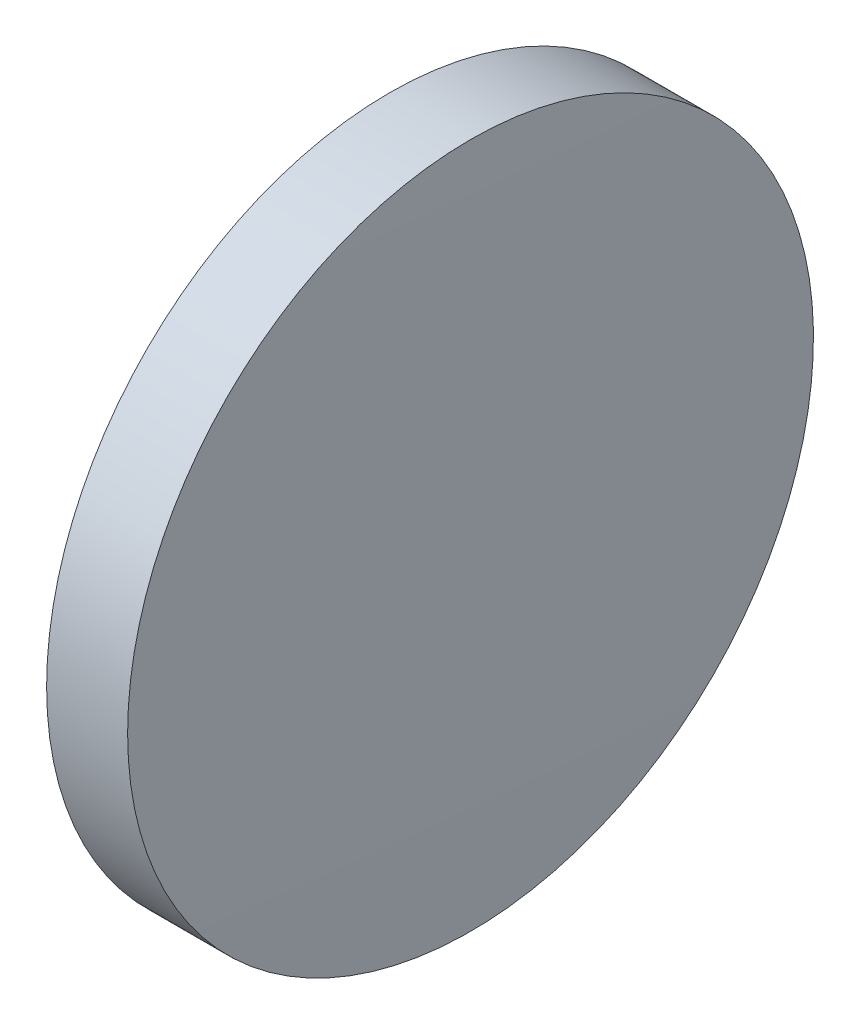
ISO-10303-21;
HEADER;
FILE_DESCRIPTION(('STEP AP214'),'2;1');
FILE_NAME('part.step','',(''),(''),'','','');
FILE_SCHEMA(('AUTOMOTIVE_DESIGN { 1 0 10303 214 1 1 1 1 }'));
ENDSEC;
DATA;
#1=APPLICATION_CONTEXT('core data for automotive mechanical design processes');
#2=APPLICATION_PROTOCOL_DEFINITION('international standard','automotive_design',2000,#1);
#3=PRODUCT_CONTEXT('',#1,'mechanical');
#4=PRODUCT('Part','Part','',(#3));
#5=PRODUCT_RELATED_PRODUCT_CATEGORY('part','',(#4));
#6=PRODUCT_DEFINITION_FORMATION('','',#4);
#7=PRODUCT_DEFINITION_CONTEXT('part definition',#1,'design');
#8=PRODUCT_DEFINITION('design','',#6,#7);
#9=PRODUCT_DEFINITION_SHAPE('','',#8);
#10=(LENGTH_UNIT() NAMED_UNIT(*) SI_UNIT(.MILLI.,.METRE.));
#11=(NAMED_UNIT(*) PLANE_ANGLE_UNIT() SI_UNIT($,.RADIAN.));
#12=(NAMED_UNIT(*) SI_UNIT($,.STERADIAN.) SOLID_ANGLE_UNIT());
#13=UNCERTAINTY_MEASURE_WITH_UNIT(LENGTH_MEASURE(1.E-05),#10,'distance_accuracy_value','');
#14=(GEOMETRIC_REPRESENTATION_CONTEXT(3) GLOBAL_UNCERTAINTY_ASSIGNED_CONTEXT((#13)) GLOBAL_UNIT_ASSIGNED_CONTEXT((#10,
#11,#12)) REPRESENTATION_CONTEXT('',''));
#15=CARTESIAN_POINT('',(0.,0.,0.));
#16=DIRECTION('',(0.,0.,1.));
#17=DIRECTION('',(1.,0.,0.));
#18=AXIS2_PLACEMENT_3D('',#15,#16,#17);
#19=CARTESIAN_POINT('',(817.917717647857,48.6161130231888,0.));
#20=DIRECTION('',(-1.,0.,0.));
#21=DIRECTION('',(0.,1.,0.));
#22=AXIS2_PLACEMENT_3D('',#19,#20,#21);
#23=SPHERICAL_SURFACE('',#22,733.069521016052);
#24=CARTESIAN_POINT('',(84.9582149175197,48.6161130231848,0.));
#25=DIRECTION('',(-1.,0.,0.));
#26=DIRECTION('',(0.,0.,1.));
#27=AXIS2_PLACEMENT_3D('',#24,#25,#26);
#28=CIRCLE('',#27,12.6999999999996);
#29=CARTESIAN_POINT('',(84.9582149175197,48.6161130231848,12.6999999999996));
#30=VERTEX_POINT('',#29);
#31=EDGE_CURVE('E46',#30,#30,#28,.T.);
#32=ORIENTED_EDGE('',*,*,#31,.T.);
#33=EDGE_LOOP('',(#32));
#34=FACE_BOUND('',#33,.T.);
#35=ADVANCED_FACE('F39',(#34),#23,.T.);
#36=CARTESIAN_POINT('',(-645.001330098853,48.6161130231845,0.));
#37=DIRECTION('',(-1.,0.,0.));
#38=DIRECTION('',(0.,1.,0.));
#39=AXIS2_PLACEMENT_3D('',#36,#37,#38);
#40=SPHERICAL_SURFACE('',#39,733.069521016373);
#41=CARTESIAN_POINT('',(87.9581726318054,48.6161130231848,0.));
#42=DIRECTION('',(-1.,0.,0.));
#43=DIRECTION('',(0.,0.,1.));
#44=AXIS2_PLACEMENT_3D('',#41,#42,#43);
#45=CIRCLE('',#44,12.7);
#46=CARTESIAN_POINT('',(87.9581726318054,48.6161130231848,12.7));
#47=VERTEX_POINT('',#46);
#48=EDGE_CURVE('E10',#47,#47,#45,.T.);
#49=ORIENTED_EDGE('',*,*,#48,.F.);
#50=EDGE_LOOP('',(#49));
#51=FACE_BOUND('',#50,.T.);
#52=ADVANCED_FACE('F56',(#51),#40,.T.);
#53=CARTESIAN_POINT('',(83.3719810515267,48.6161130231848,0.));
#54=DIRECTION('',(-1.,0.,0.));
#55=DIRECTION('',(0.,0.,1.));
#56=AXIS2_PLACEMENT_3D('',#53,#54,#55);
#57=CYLINDRICAL_SURFACE('',#56,12.6999999999998);
#58=ORIENTED_EDGE('',*,*,#48,.T.);
#59=EDGE_LOOP('',(#58));
#60=FACE_BOUND('',#59,.T.);
#61=ORIENTED_EDGE('',*,*,#31,.F.);
#62=EDGE_LOOP('',(#61));
#63=FACE_BOUND('',#62,.T.);
#64=ADVANCED_FACE('F54',(#60,#63),#57,.T.);
#65=CLOSED_SHELL('',(#35,#52,#64));
#66=MANIFOLD_SOLID_BREP('B2',#65);
#67=ADVANCED_BREP_SHAPE_REPRESENTATION('',(#18,#66),#14);
#68=SHAPE_DEFINITION_REPRESENTATION(#9,#67);
ENDSEC;
END-ISO-10303-21;
